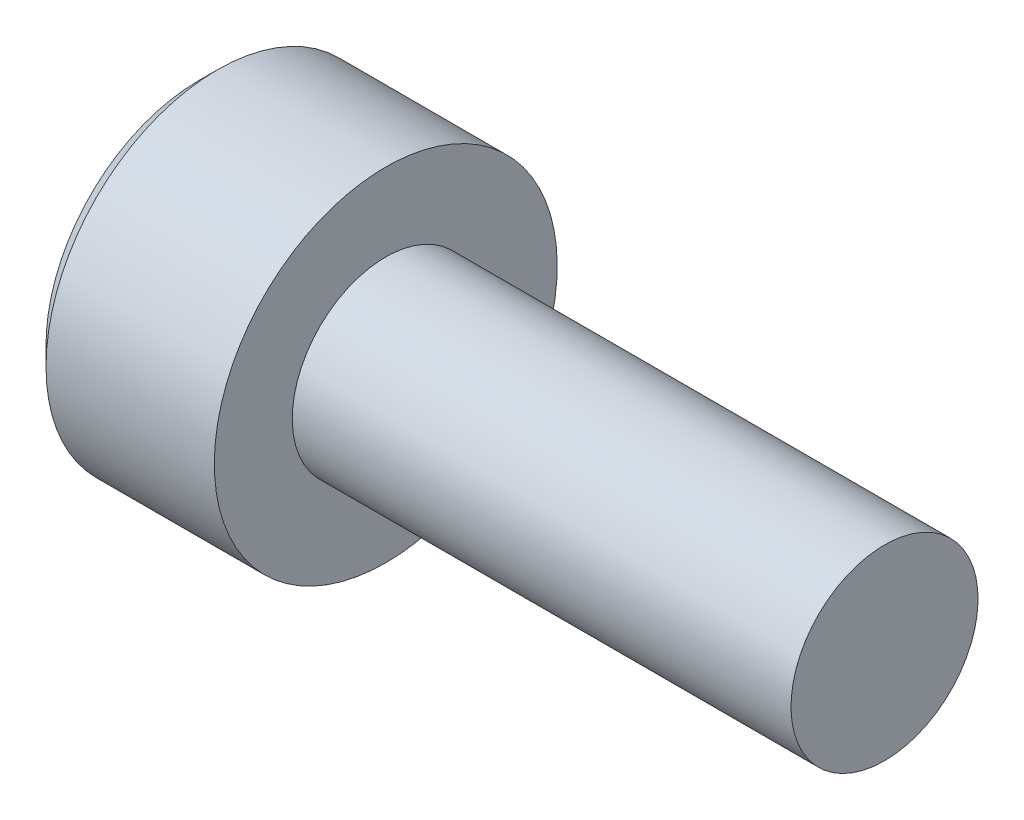
ISO-10303-21;
HEADER;
FILE_DESCRIPTION(('STEP AP214'),'2;1');
FILE_NAME('part.step','',(''),(''),'','','');
FILE_SCHEMA(('AUTOMOTIVE_DESIGN { 1 0 10303 214 1 1 1 1 }'));
ENDSEC;
DATA;
#1=APPLICATION_CONTEXT('core data for automotive mechanical design processes');
#2=APPLICATION_PROTOCOL_DEFINITION('international standard','automotive_design',2000,#1);
#3=PRODUCT_CONTEXT('',#1,'mechanical');
#4=PRODUCT('Part','Part','',(#3));
#5=PRODUCT_RELATED_PRODUCT_CATEGORY('part','',(#4));
#6=PRODUCT_DEFINITION_FORMATION('','',#4);
#7=PRODUCT_DEFINITION_CONTEXT('part definition',#1,'design');
#8=PRODUCT_DEFINITION('design','',#6,#7);
#9=PRODUCT_DEFINITION_SHAPE('','',#8);
#10=(LENGTH_UNIT() NAMED_UNIT(*) SI_UNIT(.MILLI.,.METRE.));
#11=(NAMED_UNIT(*) PLANE_ANGLE_UNIT() SI_UNIT($,.RADIAN.));
#12=(NAMED_UNIT(*) SI_UNIT($,.STERADIAN.) SOLID_ANGLE_UNIT());
#13=UNCERTAINTY_MEASURE_WITH_UNIT(LENGTH_MEASURE(1.E-05),#10,'distance_accuracy_value','');
#14=(GEOMETRIC_REPRESENTATION_CONTEXT(3) GLOBAL_UNCERTAINTY_ASSIGNED_CONTEXT((#13)) GLOBAL_UNIT_ASSIGNED_CONTEXT((#10,
#11,#12)) REPRESENTATION_CONTEXT('',''));
#15=CARTESIAN_POINT('',(0.,0.,0.));
#16=DIRECTION('',(0.,0.,1.));
#17=DIRECTION('',(1.,0.,0.));
#18=AXIS2_PLACEMENT_3D('',#15,#16,#17);
#19=CARTESIAN_POINT('',(-3.,0.,0.));
#20=DIRECTION('',(1.,0.,0.));
#21=DIRECTION('',(0.,1.,0.));
#22=AXIS2_PLACEMENT_3D('',#19,#20,#21);
#23=PLANE('',#22);
#24=CARTESIAN_POINT('',(-3.,0.,0.));
#25=DIRECTION('',(1.,0.,0.));
#26=DIRECTION('',(0.,1.,0.));
#27=AXIS2_PLACEMENT_3D('',#24,#25,#26);
#28=CIRCLE('',#27,2.45);
#29=CARTESIAN_POINT('',(-3.,2.45,0.));
#30=VERTEX_POINT('',#29);
#31=EDGE_CURVE('E45',#30,#30,#28,.F.);
#32=ORIENTED_EDGE('',*,*,#31,.T.);
#33=EDGE_LOOP('',(#32));
#34=FACE_BOUND('',#33,.T.);
#35=DIRECTION('',(0.,0.5,-0.866025403784439));
#36=VECTOR('',#35,1.);
#37=CARTESIAN_POINT('',(-3.,0.721687836487032,1.25));
#38=LINE('',#37,#36);
#39=CARTESIAN_POINT('',(-3.,0.721687836487031,1.25));
#40=VERTEX_POINT('',#39);
#41=CARTESIAN_POINT('',(-3.,1.44337567297406,0.));
#42=VERTEX_POINT('',#41);
#43=EDGE_CURVE('E150',#40,#42,#38,.T.);
#44=ORIENTED_EDGE('',*,*,#43,.F.);
#45=DIRECTION('',(0.,1.,0.));
#46=VECTOR('',#45,1.);
#47=CARTESIAN_POINT('',(-3.,-0.721687836487034,1.25));
#48=LINE('',#47,#46);
#49=CARTESIAN_POINT('',(-3.,-0.721687836487034,1.25));
#50=VERTEX_POINT('',#49);
#51=EDGE_CURVE('E123',#50,#40,#48,.T.);
#52=ORIENTED_EDGE('',*,*,#51,.F.);
#53=DIRECTION('',(0.,0.5,0.866025403784439));
#54=VECTOR('',#53,1.);
#55=CARTESIAN_POINT('',(-3.,-1.44337567297407,0.));
#56=LINE('',#55,#54);
#57=CARTESIAN_POINT('',(-3.,-1.44337567297407,0.));
#58=VERTEX_POINT('',#57);
#59=EDGE_CURVE('E119',#58,#50,#56,.T.);
#60=ORIENTED_EDGE('',*,*,#59,.F.);
#61=DIRECTION('',(0.,-0.5,0.866025403784439));
#62=VECTOR('',#61,1.);
#63=CARTESIAN_POINT('',(-3.,-0.721687836487033,-1.25));
#64=LINE('',#63,#62);
#65=CARTESIAN_POINT('',(-3.,-0.721687836487033,-1.25));
#66=VERTEX_POINT('',#65);
#67=EDGE_CURVE('E156',#66,#58,#64,.T.);
#68=ORIENTED_EDGE('',*,*,#67,.F.);
#69=DIRECTION('',(0.,-1.,0.));
#70=VECTOR('',#69,1.);
#71=CARTESIAN_POINT('',(-3.,0.721687836487032,-1.25));
#72=LINE('',#71,#70);
#73=CARTESIAN_POINT('',(-3.,0.721687836487032,-1.25));
#74=VERTEX_POINT('',#73);
#75=EDGE_CURVE('E154',#74,#66,#72,.T.);
#76=ORIENTED_EDGE('',*,*,#75,.F.);
#77=DIRECTION('',(0.,-0.5,-0.866025403784439));
#78=VECTOR('',#77,1.);
#79=CARTESIAN_POINT('',(-3.,1.44337567297406,0.));
#80=LINE('',#79,#78);
#81=EDGE_CURVE('E152',#42,#74,#80,.T.);
#82=ORIENTED_EDGE('',*,*,#81,.F.);
#83=EDGE_LOOP('',(#44,#52,#60,#68,#76,#82));
#84=FACE_BOUND('',#83,.T.);
#85=ADVANCED_FACE('F37',(#34,#84),#23,.F.);
#86=CARTESIAN_POINT('',(0.,1.5,0.));
#87=DIRECTION('',(-1.,0.,0.));
#88=DIRECTION('',(0.,-1.,0.));
#89=AXIS2_PLACEMENT_3D('',#86,#87,#88);
#90=PLANE('',#89);
#91=CARTESIAN_POINT('',(0.,0.,0.));
#92=DIRECTION('',(-1.,0.,0.));
#93=DIRECTION('',(0.,-1.,0.));
#94=AXIS2_PLACEMENT_3D('',#91,#92,#93);
#95=CIRCLE('',#94,2.75);
#96=CARTESIAN_POINT('',(0.,-2.75,0.));
#97=VERTEX_POINT('',#96);
#98=EDGE_CURVE('E182',#97,#97,#95,.T.);
#99=ORIENTED_EDGE('',*,*,#98,.F.);
#100=EDGE_LOOP('',(#99));
#101=FACE_BOUND('',#100,.T.);
#102=CARTESIAN_POINT('',(0.,0.,0.));
#103=DIRECTION('',(-1.,0.,0.));
#104=DIRECTION('',(0.,-1.,0.));
#105=AXIS2_PLACEMENT_3D('',#102,#103,#104);
#106=CIRCLE('',#105,1.5);
#107=CARTESIAN_POINT('',(0.,-1.5,0.));
#108=VERTEX_POINT('',#107);
#109=EDGE_CURVE('E176',#108,#108,#106,.T.);
#110=ORIENTED_EDGE('',*,*,#109,.T.);
#111=EDGE_LOOP('',(#110));
#112=FACE_BOUND('',#111,.T.);
#113=ADVANCED_FACE('F200',(#101,#112),#90,.F.);
#114=CARTESIAN_POINT('',(-3.,0.,0.));
#115=DIRECTION('',(-1.,0.,0.));
#116=DIRECTION('',(0.,-1.,0.));
#117=AXIS2_PLACEMENT_3D('',#114,#115,#116);
#118=CYLINDRICAL_SURFACE('',#117,2.75);
#119=CARTESIAN_POINT('',(-2.7,0.,0.));
#120=DIRECTION('',(1.,0.,0.));
#121=DIRECTION('',(0.,1.,0.));
#122=AXIS2_PLACEMENT_3D('',#119,#120,#121);
#123=CIRCLE('',#122,2.75);
#124=CARTESIAN_POINT('',(-2.7,2.75,0.));
#125=VERTEX_POINT('',#124);
#126=EDGE_CURVE('E11',#125,#125,#123,.T.);
#127=ORIENTED_EDGE('',*,*,#126,.T.);
#128=EDGE_LOOP('',(#127));
#129=FACE_BOUND('',#128,.T.);
#130=ORIENTED_EDGE('',*,*,#98,.T.);
#131=EDGE_LOOP('',(#130));
#132=FACE_BOUND('',#131,.T.);
#133=ADVANCED_FACE('F205',(#129,#132),#118,.T.);
#134=CARTESIAN_POINT('',(8.,1.5,0.));
#135=DIRECTION('',(-1.,0.,0.));
#136=DIRECTION('',(0.,-1.,0.));
#137=AXIS2_PLACEMENT_3D('',#134,#135,#136);
#138=PLANE('',#137);
#139=CARTESIAN_POINT('',(8.,0.,0.));
#140=DIRECTION('',(-1.,0.,0.));
#141=DIRECTION('',(0.,-1.,0.));
#142=AXIS2_PLACEMENT_3D('',#139,#140,#141);
#143=CIRCLE('',#142,1.5);
#144=CARTESIAN_POINT('',(8.,-1.5,0.));
#145=VERTEX_POINT('',#144);
#146=EDGE_CURVE('E179',#145,#145,#143,.T.);
#147=ORIENTED_EDGE('',*,*,#146,.F.);
#148=EDGE_LOOP('',(#147));
#149=FACE_BOUND('',#148,.T.);
#150=ADVANCED_FACE('F209',(#149),#138,.F.);
#151=CARTESIAN_POINT('',(-3.,0.,0.));
#152=DIRECTION('',(-1.,0.,0.));
#153=DIRECTION('',(0.,-1.,0.));
#154=AXIS2_PLACEMENT_3D('',#151,#152,#153);
#155=CYLINDRICAL_SURFACE('',#154,1.5);
#156=ORIENTED_EDGE('',*,*,#109,.F.);
#157=EDGE_LOOP('',(#156));
#158=FACE_BOUND('',#157,.T.);
#159=ORIENTED_EDGE('',*,*,#146,.T.);
#160=EDGE_LOOP('',(#159));
#161=FACE_BOUND('',#160,.T.);
#162=ADVANCED_FACE('F216',(#158,#161),#155,.T.);
#163=CARTESIAN_POINT('',(-1.7,-0.721687836487034,1.25));
#164=DIRECTION('',(0.,0.,1.));
#165=DIRECTION('',(0.,-1.,0.));
#166=AXIS2_PLACEMENT_3D('',#163,#164,#165);
#167=PLANE('',#166);
#168=DIRECTION('',(0.,1.,0.));
#169=VECTOR('',#168,1.);
#170=CARTESIAN_POINT('',(-1.7,-0.721687836487034,1.25));
#171=LINE('',#170,#169);
#172=CARTESIAN_POINT('',(-1.7,-0.721687836487034,1.25));
#173=VERTEX_POINT('',#172);
#174=CARTESIAN_POINT('',(-1.7,0.,1.25));
#175=VERTEX_POINT('',#174);
#176=EDGE_CURVE('E60',#173,#175,#171,.T.);
#177=ORIENTED_EDGE('',*,*,#176,.F.);
#178=DIRECTION('',(-1.,0.,0.));
#179=VECTOR('',#178,1.);
#180=CARTESIAN_POINT('',(-1.7,-0.721687836487034,1.25));
#181=LINE('',#180,#179);
#182=EDGE_CURVE('E160',#173,#50,#181,.T.);
#183=ORIENTED_EDGE('',*,*,#182,.T.);
#184=ORIENTED_EDGE('',*,*,#51,.T.);
#185=DIRECTION('',(-1.,0.,0.));
#186=VECTOR('',#185,1.);
#187=CARTESIAN_POINT('',(-1.7,0.721687836487032,1.25));
#188=LINE('',#187,#186);
#189=CARTESIAN_POINT('',(-1.7,0.721687836487032,1.25));
#190=VERTEX_POINT('',#189);
#191=EDGE_CURVE('E52',#190,#40,#188,.T.);
#192=ORIENTED_EDGE('',*,*,#191,.F.);
#193=EDGE_CURVE('E112',#175,#190,#171,.T.);
#194=ORIENTED_EDGE('',*,*,#193,.F.);
#195=EDGE_LOOP('',(#177,#183,#184,#192,#194));
#196=FACE_BOUND('',#195,.T.);
#197=ADVANCED_FACE('F121',(#196),#167,.F.);
#198=CARTESIAN_POINT('',(-1.7,-1.44337567297407,0.));
#199=DIRECTION('',(0.,-0.866025403784439,0.5));
#200=DIRECTION('',(0.,-0.5,-0.866025403784439));
#201=AXIS2_PLACEMENT_3D('',#198,#199,#200);
#202=PLANE('',#201);
#203=DIRECTION('',(0.,0.5,0.866025403784439));
#204=VECTOR('',#203,1.);
#205=CARTESIAN_POINT('',(-1.7,-1.44337567297407,0.));
#206=LINE('',#205,#204);
#207=CARTESIAN_POINT('',(-1.7,-1.44337567297407,0.));
#208=VERTEX_POINT('',#207);
#209=CARTESIAN_POINT('',(-1.7,-1.08253175473055,0.625000000000001));
#210=VERTEX_POINT('',#209);
#211=EDGE_CURVE('E126',#208,#210,#206,.T.);
#212=ORIENTED_EDGE('',*,*,#211,.F.);
#213=DIRECTION('',(-1.,0.,0.));
#214=VECTOR('',#213,1.);
#215=CARTESIAN_POINT('',(-1.7,-1.44337567297407,0.));
#216=LINE('',#215,#214);
#217=EDGE_CURVE('E163',#208,#58,#216,.T.);
#218=ORIENTED_EDGE('',*,*,#217,.T.);
#219=ORIENTED_EDGE('',*,*,#59,.T.);
#220=ORIENTED_EDGE('',*,*,#182,.F.);
#221=EDGE_CURVE('E146',#210,#173,#206,.T.);
#222=ORIENTED_EDGE('',*,*,#221,.F.);
#223=EDGE_LOOP('',(#212,#218,#219,#220,#222));
#224=FACE_BOUND('',#223,.T.);
#225=ADVANCED_FACE('F229',(#224),#202,.F.);
#226=CARTESIAN_POINT('',(-1.7,-0.721687836487033,-1.25));
#227=DIRECTION('',(0.,-0.866025403784439,-0.5));
#228=DIRECTION('',(0.,0.5,-0.866025403784439));
#229=AXIS2_PLACEMENT_3D('',#226,#227,#228);
#230=PLANE('',#229);
#231=DIRECTION('',(0.,-0.5,0.866025403784439));
#232=VECTOR('',#231,1.);
#233=CARTESIAN_POINT('',(-1.7,-0.721687836487033,-1.25));
#234=LINE('',#233,#232);
#235=CARTESIAN_POINT('',(-1.7,-0.721687836487033,-1.25));
#236=VERTEX_POINT('',#235);
#237=CARTESIAN_POINT('',(-1.7,-1.08253175473055,-0.625));
#238=VERTEX_POINT('',#237);
#239=EDGE_CURVE('E143',#236,#238,#234,.T.);
#240=ORIENTED_EDGE('',*,*,#239,.F.);
#241=DIRECTION('',(-1.,0.,0.));
#242=VECTOR('',#241,1.);
#243=CARTESIAN_POINT('',(-1.7,-0.721687836487033,-1.25));
#244=LINE('',#243,#242);
#245=EDGE_CURVE('E166',#236,#66,#244,.T.);
#246=ORIENTED_EDGE('',*,*,#245,.T.);
#247=ORIENTED_EDGE('',*,*,#67,.T.);
#248=ORIENTED_EDGE('',*,*,#217,.F.);
#249=EDGE_CURVE('E142',#238,#208,#234,.T.);
#250=ORIENTED_EDGE('',*,*,#249,.F.);
#251=EDGE_LOOP('',(#240,#246,#247,#248,#250));
#252=FACE_BOUND('',#251,.T.);
#253=ADVANCED_FACE('F241',(#252),#230,.F.);
#254=CARTESIAN_POINT('',(-1.7,0.721687836487032,-1.25));
#255=DIRECTION('',(0.,0.,-1.));
#256=DIRECTION('',(-1.,0.,0.));
#257=AXIS2_PLACEMENT_3D('',#254,#255,#256);
#258=PLANE('',#257);
#259=DIRECTION('',(0.,-1.,0.));
#260=VECTOR('',#259,1.);
#261=CARTESIAN_POINT('',(-1.7,0.721687836487032,-1.25));
#262=LINE('',#261,#260);
#263=CARTESIAN_POINT('',(-1.7,0.721687836487032,-1.25));
#264=VERTEX_POINT('',#263);
#265=CARTESIAN_POINT('',(-1.7,0.,-1.25));
#266=VERTEX_POINT('',#265);
#267=EDGE_CURVE('E139',#264,#266,#262,.T.);
#268=ORIENTED_EDGE('',*,*,#267,.F.);
#269=DIRECTION('',(-1.,0.,0.));
#270=VECTOR('',#269,1.);
#271=CARTESIAN_POINT('',(-1.7,0.721687836487032,-1.25));
#272=LINE('',#271,#270);
#273=EDGE_CURVE('E169',#264,#74,#272,.T.);
#274=ORIENTED_EDGE('',*,*,#273,.T.);
#275=ORIENTED_EDGE('',*,*,#75,.T.);
#276=ORIENTED_EDGE('',*,*,#245,.F.);
#277=EDGE_CURVE('E138',#266,#236,#262,.T.);
#278=ORIENTED_EDGE('',*,*,#277,.F.);
#279=EDGE_LOOP('',(#268,#274,#275,#276,#278));
#280=FACE_BOUND('',#279,.T.);
#281=ADVANCED_FACE('F237',(#280),#258,.F.);
#282=CARTESIAN_POINT('',(-1.7,1.44337567297406,0.));
#283=DIRECTION('',(0.,0.866025403784439,-0.5));
#284=DIRECTION('',(0.,0.5,0.866025403784439));
#285=AXIS2_PLACEMENT_3D('',#282,#283,#284);
#286=PLANE('',#285);
#287=DIRECTION('',(0.,-0.5,-0.866025403784439));
#288=VECTOR('',#287,1.);
#289=CARTESIAN_POINT('',(-1.7,1.44337567297406,0.));
#290=LINE('',#289,#288);
#291=CARTESIAN_POINT('',(-1.7,1.44337567297406,0.));
#292=VERTEX_POINT('',#291);
#293=CARTESIAN_POINT('',(-1.7,1.08253175473055,-0.625));
#294=VERTEX_POINT('',#293);
#295=EDGE_CURVE('E134',#292,#294,#290,.T.);
#296=ORIENTED_EDGE('',*,*,#295,.F.);
#297=DIRECTION('',(-1.,0.,0.));
#298=VECTOR('',#297,1.);
#299=CARTESIAN_POINT('',(-1.7,1.44337567297406,0.));
#300=LINE('',#299,#298);
#301=EDGE_CURVE('E125',#292,#42,#300,.T.);
#302=ORIENTED_EDGE('',*,*,#301,.T.);
#303=ORIENTED_EDGE('',*,*,#81,.T.);
#304=ORIENTED_EDGE('',*,*,#273,.F.);
#305=EDGE_CURVE('E132',#294,#264,#290,.T.);
#306=ORIENTED_EDGE('',*,*,#305,.F.);
#307=EDGE_LOOP('',(#296,#302,#303,#304,#306));
#308=FACE_BOUND('',#307,.T.);
#309=ADVANCED_FACE('F234',(#308),#286,.F.);
#310=CARTESIAN_POINT('',(-1.7,0.721687836487032,1.25));
#311=DIRECTION('',(0.,0.866025403784439,0.5));
#312=DIRECTION('',(0.,-0.5,0.866025403784439));
#313=AXIS2_PLACEMENT_3D('',#310,#311,#312);
#314=PLANE('',#313);
#315=DIRECTION('',(0.,0.5,-0.866025403784439));
#316=VECTOR('',#315,1.);
#317=CARTESIAN_POINT('',(-1.7,0.721687836487032,1.25));
#318=LINE('',#317,#316);
#319=CARTESIAN_POINT('',(-1.7,1.08253175473055,0.625));
#320=VERTEX_POINT('',#319);
#321=EDGE_CURVE('E114',#190,#320,#318,.T.);
#322=ORIENTED_EDGE('',*,*,#321,.F.);
#323=ORIENTED_EDGE('',*,*,#191,.T.);
#324=ORIENTED_EDGE('',*,*,#43,.T.);
#325=ORIENTED_EDGE('',*,*,#301,.F.);
#326=EDGE_CURVE('E131',#320,#292,#318,.T.);
#327=ORIENTED_EDGE('',*,*,#326,.F.);
#328=EDGE_LOOP('',(#322,#323,#324,#325,#327));
#329=FACE_BOUND('',#328,.T.);
#330=ADVANCED_FACE('F129',(#329),#314,.F.);
#331=CARTESIAN_POINT('',(-1.7,0.,0.));
#332=DIRECTION('',(-1.,0.,0.));
#333=DIRECTION('',(0.,0.,1.));
#334=AXIS2_PLACEMENT_3D('',#331,#332,#333);
#335=PLANE('',#334);
#336=ORIENTED_EDGE('',*,*,#193,.T.);
#337=ORIENTED_EDGE('',*,*,#321,.T.);
#338=CARTESIAN_POINT('',(-1.7,0.,0.));
#339=DIRECTION('',(-1.,0.,0.));
#340=DIRECTION('',(0.,-1.,0.));
#341=AXIS2_PLACEMENT_3D('',#338,#339,#340);
#342=CIRCLE('',#341,1.25);
#343=EDGE_CURVE('E116',#175,#320,#342,.T.);
#344=ORIENTED_EDGE('',*,*,#343,.F.);
#345=EDGE_LOOP('',(#336,#337,#344));
#346=FACE_BOUND('',#345,.T.);
#347=ADVANCED_FACE('F113',(#346),#335,.T.);
#348=ORIENTED_EDGE('',*,*,#326,.T.);
#349=ORIENTED_EDGE('',*,*,#295,.T.);
#350=EDGE_CURVE('E269',#320,#294,#342,.T.);
#351=ORIENTED_EDGE('',*,*,#350,.F.);
#352=EDGE_LOOP('',(#348,#349,#351));
#353=FACE_BOUND('',#352,.T.);
#354=ADVANCED_FACE('F257',(#353),#335,.T.);
#355=ORIENTED_EDGE('',*,*,#305,.T.);
#356=ORIENTED_EDGE('',*,*,#267,.T.);
#357=EDGE_CURVE('E275',#294,#266,#342,.T.);
#358=ORIENTED_EDGE('',*,*,#357,.F.);
#359=EDGE_LOOP('',(#355,#356,#358));
#360=FACE_BOUND('',#359,.T.);
#361=ADVANCED_FACE('F261',(#360),#335,.T.);
#362=ORIENTED_EDGE('',*,*,#277,.T.);
#363=ORIENTED_EDGE('',*,*,#239,.T.);
#364=EDGE_CURVE('E277',#266,#238,#342,.T.);
#365=ORIENTED_EDGE('',*,*,#364,.F.);
#366=EDGE_LOOP('',(#362,#363,#365));
#367=FACE_BOUND('',#366,.T.);
#368=ADVANCED_FACE('F254',(#367),#335,.T.);
#369=ORIENTED_EDGE('',*,*,#249,.T.);
#370=ORIENTED_EDGE('',*,*,#211,.T.);
#371=EDGE_CURVE('E162',#238,#210,#342,.T.);
#372=ORIENTED_EDGE('',*,*,#371,.F.);
#373=EDGE_LOOP('',(#369,#370,#372));
#374=FACE_BOUND('',#373,.T.);
#375=ADVANCED_FACE('F250',(#374),#335,.T.);
#376=ORIENTED_EDGE('',*,*,#221,.T.);
#377=ORIENTED_EDGE('',*,*,#176,.T.);
#378=EDGE_CURVE('E174',#210,#175,#342,.T.);
#379=ORIENTED_EDGE('',*,*,#378,.F.);
#380=EDGE_LOOP('',(#376,#377,#379));
#381=FACE_BOUND('',#380,.T.);
#382=ADVANCED_FACE('F195',(#381),#335,.T.);
#383=CARTESIAN_POINT('',(-0.948924226215541,0.,0.));
#384=DIRECTION('',(-1.,0.,0.));
#385=DIRECTION('',(0.,-1.,0.));
#386=AXIS2_PLACEMENT_3D('',#383,#384,#385);
#387=CONICAL_SURFACE('',#386,0.,1.02974425867665);
#388=ORIENTED_EDGE('',*,*,#378,.T.);
#389=ORIENTED_EDGE('',*,*,#343,.T.);
#390=ORIENTED_EDGE('',*,*,#350,.T.);
#391=ORIENTED_EDGE('',*,*,#357,.T.);
#392=ORIENTED_EDGE('',*,*,#364,.T.);
#393=ORIENTED_EDGE('',*,*,#371,.T.);
#394=EDGE_LOOP('',(#388,#389,#390,#391,#392,#393));
#395=FACE_BOUND('',#394,.T.);
#396=CARTESIAN_POINT('',(-0.948924226215541,0.,0.));
#397=VERTEX_POINT('',#396);
#398=VERTEX_LOOP('',#397);
#399=FACE_BOUND('',#398,.T.);
#400=ADVANCED_FACE('F190',(#395,#399),#387,.F.);
#401=CARTESIAN_POINT('',(-3.,0.,0.));
#402=DIRECTION('',(1.,0.,0.));
#403=DIRECTION('',(0.,1.,0.));
#404=AXIS2_PLACEMENT_3D('',#401,#402,#403);
#405=CONICAL_SURFACE('',#404,2.45,0.785398163397447);
#406=ORIENTED_EDGE('',*,*,#126,.F.);
#407=EDGE_LOOP('',(#406));
#408=FACE_BOUND('',#407,.T.);
#409=ORIENTED_EDGE('',*,*,#31,.F.);
#410=EDGE_LOOP('',(#409));
#411=FACE_BOUND('',#410,.T.);
#412=ADVANCED_FACE('F39',(#408,#411),#405,.T.);
#413=CLOSED_SHELL('',(#85,#113,#133,#150,#162,#197,#225,#253,#281,#309,#330,#347,#354,#361,#368,
#375,#382,#400,#412));
#414=MANIFOLD_SOLID_BREP('B2',#413);
#415=ADVANCED_BREP_SHAPE_REPRESENTATION('',(#18,#414),#14);
#416=SHAPE_DEFINITION_REPRESENTATION(#9,#415);
ENDSEC;
END-ISO-10303-21;
